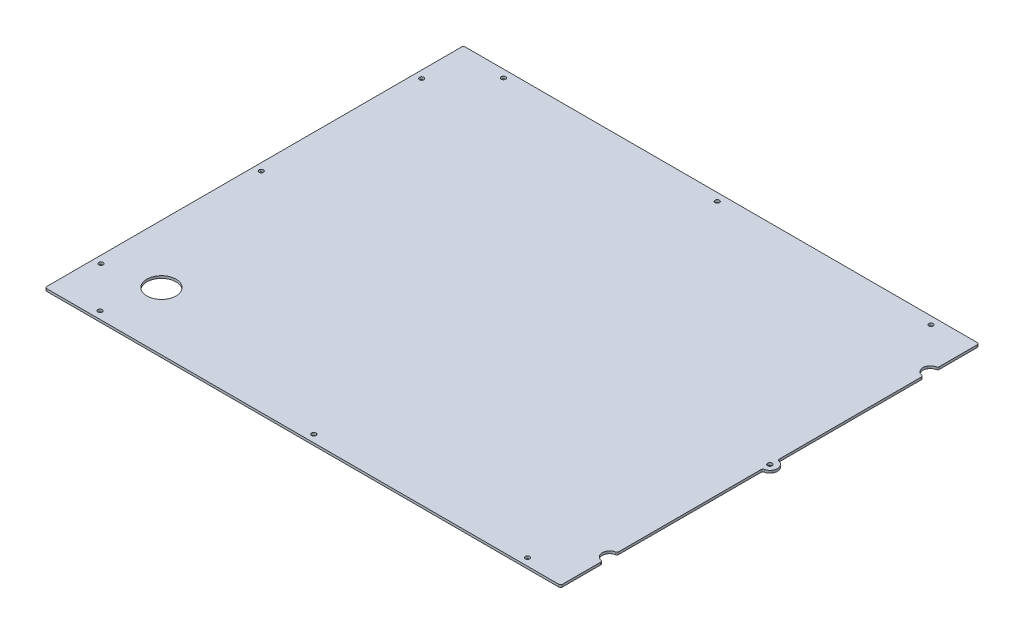
ISO-10303-21;
HEADER;
FILE_DESCRIPTION(('STEP AP214'),'2;1');
FILE_NAME('part.step','',(''),(''),'','','');
FILE_SCHEMA(('AUTOMOTIVE_DESIGN { 1 0 10303 214 1 1 1 1 }'));
ENDSEC;
DATA;
#1=APPLICATION_CONTEXT('core data for automotive mechanical design processes');
#2=APPLICATION_PROTOCOL_DEFINITION('international standard','automotive_design',2000,#1);
#3=PRODUCT_CONTEXT('',#1,'mechanical');
#4=PRODUCT('Part','Part','',(#3));
#5=PRODUCT_RELATED_PRODUCT_CATEGORY('part','',(#4));
#6=PRODUCT_DEFINITION_FORMATION('','',#4);
#7=PRODUCT_DEFINITION_CONTEXT('part definition',#1,'design');
#8=PRODUCT_DEFINITION('design','',#6,#7);
#9=PRODUCT_DEFINITION_SHAPE('','',#8);
#10=(LENGTH_UNIT() NAMED_UNIT(*) SI_UNIT(.MILLI.,.METRE.));
#11=(NAMED_UNIT(*) PLANE_ANGLE_UNIT() SI_UNIT($,.RADIAN.));
#12=(NAMED_UNIT(*) SI_UNIT($,.STERADIAN.) SOLID_ANGLE_UNIT());
#13=UNCERTAINTY_MEASURE_WITH_UNIT(LENGTH_MEASURE(1.E-05),#10,'distance_accuracy_value','');
#14=(GEOMETRIC_REPRESENTATION_CONTEXT(3) GLOBAL_UNCERTAINTY_ASSIGNED_CONTEXT((#13)) GLOBAL_UNIT_ASSIGNED_CONTEXT((#10,
#11,#12)) REPRESENTATION_CONTEXT('',''));
#15=CARTESIAN_POINT('',(0.,0.,0.));
#16=DIRECTION('',(0.,0.,1.));
#17=DIRECTION('',(1.,0.,0.));
#18=AXIS2_PLACEMENT_3D('',#15,#16,#17);
#19=CARTESIAN_POINT('',(337.058,3.175,-209.804));
#20=DIRECTION('',(0.,1.,0.));
#21=DIRECTION('',(0.,0.,1.));
#22=AXIS2_PLACEMENT_3D('',#19,#20,#21);
#23=PLANE('',#22);
#24=CARTESIAN_POINT('',(284.226000000001,3.175,-263.398));
#25=DIRECTION('',(0.,-1.,0.));
#26=DIRECTION('',(0.,0.,-1.));
#27=AXIS2_PLACEMENT_3D('',#24,#25,#26);
#28=CIRCLE('',#27,2.8956);
#29=CARTESIAN_POINT('',(284.226000000001,3.175,-266.2936));
#30=VERTEX_POINT('',#29);
#31=EDGE_CURVE('E402',#30,#30,#28,.T.);
#32=ORIENTED_EDGE('',*,*,#31,.T.);
#33=EDGE_LOOP('',(#32));
#34=FACE_BOUND('',#33,.T.);
#35=CARTESIAN_POINT('',(4.82600000000133,3.175,-263.398));
#36=DIRECTION('',(0.,-1.,0.));
#37=DIRECTION('',(0.,0.,-1.));
#38=AXIS2_PLACEMENT_3D('',#35,#36,#37);
#39=CIRCLE('',#38,2.8956);
#40=CARTESIAN_POINT('',(4.82600000000133,3.175,-266.2936));
#41=VERTEX_POINT('',#40);
#42=EDGE_CURVE('E396',#41,#41,#39,.T.);
#43=ORIENTED_EDGE('',*,*,#42,.T.);
#44=EDGE_LOOP('',(#43));
#45=FACE_BOUND('',#44,.T.);
#46=CARTESIAN_POINT('',(-274.573999999999,3.175,-263.398));
#47=DIRECTION('',(0.,-1.,0.));
#48=DIRECTION('',(0.,0.,-1.));
#49=AXIS2_PLACEMENT_3D('',#46,#47,#48);
#50=CIRCLE('',#49,2.8956);
#51=CARTESIAN_POINT('',(-274.573999999999,3.175,-266.2936));
#52=VERTEX_POINT('',#51);
#53=EDGE_CURVE('E390',#52,#52,#50,.T.);
#54=ORIENTED_EDGE('',*,*,#53,.T.);
#55=EDGE_LOOP('',(#54));
#56=FACE_BOUND('',#55,.T.);
#57=CARTESIAN_POINT('',(-327.406,3.175,-209.296));
#58=DIRECTION('',(0.,-1.,0.));
#59=DIRECTION('',(0.,0.,-1.));
#60=AXIS2_PLACEMENT_3D('',#57,#58,#59);
#61=CIRCLE('',#60,2.8956);
#62=CARTESIAN_POINT('',(-327.406,3.175,-212.1916));
#63=VERTEX_POINT('',#62);
#64=EDGE_CURVE('E384',#63,#63,#61,.T.);
#65=ORIENTED_EDGE('',*,*,#64,.T.);
#66=EDGE_LOOP('',(#65));
#67=FACE_BOUND('',#66,.T.);
#68=CARTESIAN_POINT('',(-327.406,3.175,0.253999999999921));
#69=DIRECTION('',(0.,-1.,0.));
#70=DIRECTION('',(0.,0.,-1.));
#71=AXIS2_PLACEMENT_3D('',#68,#69,#70);
#72=CIRCLE('',#71,2.8956);
#73=CARTESIAN_POINT('',(-327.406,3.175,-2.64160000000008));
#74=VERTEX_POINT('',#73);
#75=EDGE_CURVE('E378',#74,#74,#72,.T.);
#76=ORIENTED_EDGE('',*,*,#75,.T.);
#77=EDGE_LOOP('',(#76));
#78=FACE_BOUND('',#77,.T.);
#79=CARTESIAN_POINT('',(-327.406,3.175,209.804));
#80=DIRECTION('',(0.,-1.,0.));
#81=DIRECTION('',(0.,0.,-1.));
#82=AXIS2_PLACEMENT_3D('',#79,#80,#81);
#83=CIRCLE('',#82,2.8956);
#84=CARTESIAN_POINT('',(-327.406,3.175,206.9084));
#85=VERTEX_POINT('',#84);
#86=EDGE_CURVE('E372',#85,#85,#83,.T.);
#87=ORIENTED_EDGE('',*,*,#86,.T.);
#88=EDGE_LOOP('',(#87));
#89=FACE_BOUND('',#88,.T.);
#90=CARTESIAN_POINT('',(-274.573999999999,3.175,263.906));
#91=DIRECTION('',(0.,-1.,0.));
#92=DIRECTION('',(0.,0.,-1.));
#93=AXIS2_PLACEMENT_3D('',#90,#91,#92);
#94=CIRCLE('',#93,2.8956);
#95=CARTESIAN_POINT('',(-274.573999999999,3.175,261.0104));
#96=VERTEX_POINT('',#95);
#97=EDGE_CURVE('E366',#96,#96,#94,.T.);
#98=ORIENTED_EDGE('',*,*,#97,.T.);
#99=EDGE_LOOP('',(#98));
#100=FACE_BOUND('',#99,.T.);
#101=CARTESIAN_POINT('',(4.82600000000133,3.175,263.906));
#102=DIRECTION('',(0.,-1.,0.));
#103=DIRECTION('',(0.,0.,-1.));
#104=AXIS2_PLACEMENT_3D('',#101,#102,#103);
#105=CIRCLE('',#104,2.8956);
#106=CARTESIAN_POINT('',(4.82600000000133,3.175,261.0104));
#107=VERTEX_POINT('',#106);
#108=EDGE_CURVE('E360',#107,#107,#105,.T.);
#109=ORIENTED_EDGE('',*,*,#108,.T.);
#110=EDGE_LOOP('',(#109));
#111=FACE_BOUND('',#110,.T.);
#112=CARTESIAN_POINT('',(284.226000000001,3.175,263.906));
#113=DIRECTION('',(0.,-1.,0.));
#114=DIRECTION('',(0.,0.,-1.));
#115=AXIS2_PLACEMENT_3D('',#112,#113,#114);
#116=CIRCLE('',#115,2.8956);
#117=CARTESIAN_POINT('',(284.226000000001,3.175,261.0104));
#118=VERTEX_POINT('',#117);
#119=EDGE_CURVE('E352',#118,#118,#116,.T.);
#120=ORIENTED_EDGE('',*,*,#119,.T.);
#121=EDGE_LOOP('',(#120));
#122=FACE_BOUND('',#121,.T.);
#123=CARTESIAN_POINT('',(-260.858,3.175,197.358));
#124=DIRECTION('',(0.,1.,0.));
#125=DIRECTION('',(0.,0.,1.));
#126=AXIS2_PLACEMENT_3D('',#123,#124,#125);
#127=CIRCLE('',#126,19.05);
#128=CARTESIAN_POINT('',(-260.858,3.175,216.408));
#129=VERTEX_POINT('',#128);
#130=EDGE_CURVE('E189',#129,#129,#127,.T.);
#131=ORIENTED_EDGE('',*,*,#130,.F.);
#132=EDGE_LOOP('',(#131));
#133=FACE_BOUND('',#132,.T.);
#134=DIRECTION('',(-1.,0.,0.));
#135=VECTOR('',#134,1.);
#136=CARTESIAN_POINT('',(-337.058,3.175,-273.558));
#137=LINE('',#136,#135);
#138=CARTESIAN_POINT('',(334.518,3.175,-273.558));
#139=VERTEX_POINT('',#138);
#140=CARTESIAN_POINT('',(-334.518,3.175,-273.558));
#141=VERTEX_POINT('',#140);
#142=EDGE_CURVE('E205',#139,#141,#137,.T.);
#143=ORIENTED_EDGE('',*,*,#142,.T.);
#144=CARTESIAN_POINT('',(-334.518,3.175,-271.018));
#145=DIRECTION('',(0.,1.,0.));
#146=DIRECTION('',(0.,0.,1.));
#147=AXIS2_PLACEMENT_3D('',#144,#145,#146);
#148=CIRCLE('',#147,2.54);
#149=CARTESIAN_POINT('',(-337.058,3.175,-271.018));
#150=VERTEX_POINT('',#149);
#151=EDGE_CURVE('E302',#141,#150,#148,.T.);
#152=ORIENTED_EDGE('',*,*,#151,.T.);
#153=DIRECTION('',(0.,0.,1.));
#154=VECTOR('',#153,1.);
#155=CARTESIAN_POINT('',(-337.058,3.175,273.558));
#156=LINE('',#155,#154);
#157=CARTESIAN_POINT('',(-337.058,3.175,271.018));
#158=VERTEX_POINT('',#157);
#159=EDGE_CURVE('E208',#150,#158,#156,.T.);
#160=ORIENTED_EDGE('',*,*,#159,.T.);
#161=CARTESIAN_POINT('',(-334.518,3.175,271.018));
#162=DIRECTION('',(0.,1.,0.));
#163=DIRECTION('',(0.,0.,1.));
#164=AXIS2_PLACEMENT_3D('',#161,#162,#163);
#165=CIRCLE('',#164,2.54);
#166=CARTESIAN_POINT('',(-334.518,3.175,273.558));
#167=VERTEX_POINT('',#166);
#168=EDGE_CURVE('E300',#158,#167,#165,.T.);
#169=ORIENTED_EDGE('',*,*,#168,.T.);
#170=DIRECTION('',(1.,0.,0.));
#171=VECTOR('',#170,1.);
#172=CARTESIAN_POINT('',(-337.058,3.175,273.558));
#173=LINE('',#172,#171);
#174=CARTESIAN_POINT('',(334.518,3.175,273.558));
#175=VERTEX_POINT('',#174);
#176=EDGE_CURVE('E212',#167,#175,#173,.T.);
#177=ORIENTED_EDGE('',*,*,#176,.T.);
#178=CARTESIAN_POINT('',(334.518,3.175,271.018));
#179=DIRECTION('',(0.,1.,0.));
#180=DIRECTION('',(0.,0.,1.));
#181=AXIS2_PLACEMENT_3D('',#178,#179,#180);
#182=CIRCLE('',#181,2.54);
#183=CARTESIAN_POINT('',(337.058,3.175,271.018));
#184=VERTEX_POINT('',#183);
#185=EDGE_CURVE('E298',#175,#184,#182,.T.);
#186=ORIENTED_EDGE('',*,*,#185,.T.);
#187=DIRECTION('',(0.,0.,-1.));
#188=VECTOR('',#187,1.);
#189=CARTESIAN_POINT('',(337.058,3.175,273.558));
#190=LINE('',#189,#188);
#191=CARTESIAN_POINT('',(337.058,3.175,221.220481707814));
#192=VERTEX_POINT('',#191);
#193=EDGE_CURVE('E215',#184,#192,#190,.T.);
#194=ORIENTED_EDGE('',*,*,#193,.T.);
#195=CARTESIAN_POINT('',(334.518,3.175,221.220481707814));
#196=DIRECTION('',(0.,1.,0.));
#197=DIRECTION('',(0.,0.,1.));
#198=AXIS2_PLACEMENT_3D('',#195,#196,#197);
#199=CIRCLE('',#198,2.54);
#200=CARTESIAN_POINT('',(335.047166666667,3.175,218.736214685353));
#201=VERTEX_POINT('',#200);
#202=EDGE_CURVE('E296',#192,#201,#199,.T.);
#203=ORIENTED_EDGE('',*,*,#202,.T.);
#204=CARTESIAN_POINT('',(337.058,3.175,209.296));
#205=DIRECTION('',(0.,-1.,0.));
#206=DIRECTION('',(0.,0.,1.));
#207=AXIS2_PLACEMENT_3D('',#204,#205,#206);
#208=CIRCLE('',#207,9.65199999999997);
#209=CARTESIAN_POINT('',(335.047166666667,3.175,199.855785314647));
#210=VERTEX_POINT('',#209);
#211=EDGE_CURVE('E218',#201,#210,#208,.T.);
#212=ORIENTED_EDGE('',*,*,#211,.T.);
#213=CARTESIAN_POINT('',(334.518,3.175,197.371518292186));
#214=DIRECTION('',(0.,1.,0.));
#215=DIRECTION('',(0.,0.,1.));
#216=AXIS2_PLACEMENT_3D('',#213,#214,#215);
#217=CIRCLE('',#216,2.54);
#218=CARTESIAN_POINT('',(337.058,3.175,197.371518292186));
#219=VERTEX_POINT('',#218);
#220=EDGE_CURVE('E294',#210,#219,#217,.T.);
#221=ORIENTED_EDGE('',*,*,#220,.T.);
#222=DIRECTION('',(0.,0.,-1.));
#223=VECTOR('',#222,1.);
#224=CARTESIAN_POINT('',(337.058,3.175,199.644));
#225=LINE('',#224,#223);
#226=CARTESIAN_POINT('',(337.058,3.175,11.6704817078144));
#227=VERTEX_POINT('',#226);
#228=EDGE_CURVE('E221',#219,#227,#225,.T.);
#229=ORIENTED_EDGE('',*,*,#228,.T.);
#230=CARTESIAN_POINT('',(339.598,3.175,11.6704817078144));
#231=DIRECTION('',(0.,1.,0.));
#232=DIRECTION('',(0.,0.,1.));
#233=AXIS2_PLACEMENT_3D('',#230,#231,#232);
#234=CIRCLE('',#233,2.54);
#235=CARTESIAN_POINT('',(339.068833333333,3.175,9.18621468535305));
#236=VERTEX_POINT('',#235);
#237=EDGE_CURVE('E345',#227,#236,#234,.F.);
#238=ORIENTED_EDGE('',*,*,#237,.T.);
#239=CARTESIAN_POINT('',(337.058,3.175,-0.254000000000004));
#240=DIRECTION('',(0.,1.,0.));
#241=DIRECTION('',(0.,0.,1.));
#242=AXIS2_PLACEMENT_3D('',#239,#240,#241);
#243=CIRCLE('',#242,9.65199999999998);
#244=CARTESIAN_POINT('',(339.068833333333,3.175,-9.69421468535305));
#245=VERTEX_POINT('',#244);
#246=EDGE_CURVE('E224',#236,#245,#243,.T.);
#247=ORIENTED_EDGE('',*,*,#246,.T.);
#248=CARTESIAN_POINT('',(339.598,3.175,-12.1784817078144));
#249=DIRECTION('',(0.,1.,0.));
#250=DIRECTION('',(0.,0.,1.));
#251=AXIS2_PLACEMENT_3D('',#248,#249,#250);
#252=CIRCLE('',#251,2.54);
#253=CARTESIAN_POINT('',(337.058,3.175,-12.1784817078144));
#254=VERTEX_POINT('',#253);
#255=EDGE_CURVE('E349',#245,#254,#252,.F.);
#256=ORIENTED_EDGE('',*,*,#255,.T.);
#257=DIRECTION('',(0.,0.,-1.));
#258=VECTOR('',#257,1.);
#259=CARTESIAN_POINT('',(337.058,3.175,-9.90599999999999));
#260=LINE('',#259,#258);
#261=CARTESIAN_POINT('',(337.058,3.175,-197.879518292186));
#262=VERTEX_POINT('',#261);
#263=EDGE_CURVE('E227',#254,#262,#260,.T.);
#264=ORIENTED_EDGE('',*,*,#263,.T.);
#265=CARTESIAN_POINT('',(334.518,3.175,-197.879518292186));
#266=DIRECTION('',(0.,1.,0.));
#267=DIRECTION('',(0.,0.,1.));
#268=AXIS2_PLACEMENT_3D('',#265,#266,#267);
#269=CIRCLE('',#268,2.54);
#270=CARTESIAN_POINT('',(335.047166666667,3.175,-200.363785314647));
#271=VERTEX_POINT('',#270);
#272=EDGE_CURVE('E292',#262,#271,#269,.T.);
#273=ORIENTED_EDGE('',*,*,#272,.T.);
#274=CARTESIAN_POINT('',(337.058,3.175,-209.804));
#275=DIRECTION('',(0.,-1.,0.));
#276=DIRECTION('',(0.,0.,1.));
#277=AXIS2_PLACEMENT_3D('',#274,#275,#276);
#278=CIRCLE('',#277,9.65199999999997);
#279=CARTESIAN_POINT('',(335.047166666667,3.175,-219.244214685353));
#280=VERTEX_POINT('',#279);
#281=EDGE_CURVE('E230',#271,#280,#278,.T.);
#282=ORIENTED_EDGE('',*,*,#281,.T.);
#283=CARTESIAN_POINT('',(334.518,3.175,-221.728481707814));
#284=DIRECTION('',(0.,1.,0.));
#285=DIRECTION('',(0.,0.,1.));
#286=AXIS2_PLACEMENT_3D('',#283,#284,#285);
#287=CIRCLE('',#286,2.54);
#288=CARTESIAN_POINT('',(337.058,3.175,-221.728481707814));
#289=VERTEX_POINT('',#288);
#290=EDGE_CURVE('E290',#280,#289,#287,.T.);
#291=ORIENTED_EDGE('',*,*,#290,.T.);
#292=DIRECTION('',(0.,0.,-1.));
#293=VECTOR('',#292,1.);
#294=CARTESIAN_POINT('',(337.058,3.175,-219.456));
#295=LINE('',#294,#293);
#296=CARTESIAN_POINT('',(337.058,3.175,-271.018));
#297=VERTEX_POINT('',#296);
#298=EDGE_CURVE('E233',#289,#297,#295,.T.);
#299=ORIENTED_EDGE('',*,*,#298,.T.);
#300=CARTESIAN_POINT('',(334.518,3.175,-271.018));
#301=DIRECTION('',(0.,1.,0.));
#302=DIRECTION('',(0.,0.,1.));
#303=AXIS2_PLACEMENT_3D('',#300,#301,#302);
#304=CIRCLE('',#303,2.54);
#305=EDGE_CURVE('E288',#297,#139,#304,.T.);
#306=ORIENTED_EDGE('',*,*,#305,.T.);
#307=EDGE_LOOP('',(#143,#152,#160,#169,#177,#186,#194,#203,#212,#221,#229,#238,#247,#256,#264,
#273,#282,#291,#299,#306));
#308=FACE_BOUND('',#307,.T.);
#309=CARTESIAN_POINT('',(337.058,3.175,-0.254000000000004));
#310=DIRECTION('',(0.,1.,0.));
#311=DIRECTION('',(0.,0.,1.));
#312=AXIS2_PLACEMENT_3D('',#309,#310,#311);
#313=CIRCLE('',#312,2.8956);
#314=CARTESIAN_POINT('',(339.942438135926,3.175,3.68768058624236E-11));
#315=VERTEX_POINT('',#314);
#316=CARTESIAN_POINT('',(334.173561864068,3.175,-3.56236307813562E-11));
#317=VERTEX_POINT('',#316);
#318=EDGE_CURVE('E194',#315,#317,#313,.T.);
#319=ORIENTED_EDGE('',*,*,#318,.F.);
#320=CARTESIAN_POINT('',(337.057999999994,3.175,0.254000000001253));
#321=DIRECTION('',(0.,-1.,0.));
#322=DIRECTION('',(0.,0.,-1.));
#323=AXIS2_PLACEMENT_3D('',#320,#321,#322);
#324=CIRCLE('',#323,2.8956);
#325=EDGE_CURVE('E184',#315,#317,#324,.T.);
#326=ORIENTED_EDGE('',*,*,#325,.T.);
#327=EDGE_LOOP('',(#319,#326));
#328=FACE_BOUND('',#327,.T.);
#329=ADVANCED_FACE('F35',(#34,#45,#56,#67,#78,#89,#100,#111,#122,#133,#308,#328),#23,.T.);
#330=CARTESIAN_POINT('',(337.058,0.,-209.804));
#331=DIRECTION('',(0.,1.,0.));
#332=DIRECTION('',(0.,0.,1.));
#333=AXIS2_PLACEMENT_3D('',#330,#331,#332);
#334=PLANE('',#333);
#335=CARTESIAN_POINT('',(284.226000000001,0.,-263.398));
#336=DIRECTION('',(0.,-1.,0.));
#337=DIRECTION('',(0.,0.,-1.));
#338=AXIS2_PLACEMENT_3D('',#335,#336,#337);
#339=CIRCLE('',#338,2.8956);
#340=CARTESIAN_POINT('',(284.226000000001,0.,-266.2936));
#341=VERTEX_POINT('',#340);
#342=EDGE_CURVE('E405',#341,#341,#339,.T.);
#343=ORIENTED_EDGE('',*,*,#342,.F.);
#344=EDGE_LOOP('',(#343));
#345=FACE_BOUND('',#344,.T.);
#346=CARTESIAN_POINT('',(4.82600000000133,0.,-263.398));
#347=DIRECTION('',(0.,-1.,0.));
#348=DIRECTION('',(0.,0.,-1.));
#349=AXIS2_PLACEMENT_3D('',#346,#347,#348);
#350=CIRCLE('',#349,2.8956);
#351=CARTESIAN_POINT('',(4.82600000000133,0.,-266.2936));
#352=VERTEX_POINT('',#351);
#353=EDGE_CURVE('E399',#352,#352,#350,.T.);
#354=ORIENTED_EDGE('',*,*,#353,.F.);
#355=EDGE_LOOP('',(#354));
#356=FACE_BOUND('',#355,.T.);
#357=CARTESIAN_POINT('',(-274.573999999999,0.,-263.398));
#358=DIRECTION('',(0.,-1.,0.));
#359=DIRECTION('',(0.,0.,-1.));
#360=AXIS2_PLACEMENT_3D('',#357,#358,#359);
#361=CIRCLE('',#360,2.8956);
#362=CARTESIAN_POINT('',(-274.573999999999,0.,-266.2936));
#363=VERTEX_POINT('',#362);
#364=EDGE_CURVE('E393',#363,#363,#361,.T.);
#365=ORIENTED_EDGE('',*,*,#364,.F.);
#366=EDGE_LOOP('',(#365));
#367=FACE_BOUND('',#366,.T.);
#368=CARTESIAN_POINT('',(-327.406,0.,-209.296));
#369=DIRECTION('',(0.,-1.,0.));
#370=DIRECTION('',(0.,0.,-1.));
#371=AXIS2_PLACEMENT_3D('',#368,#369,#370);
#372=CIRCLE('',#371,2.8956);
#373=CARTESIAN_POINT('',(-327.406,0.,-212.1916));
#374=VERTEX_POINT('',#373);
#375=EDGE_CURVE('E387',#374,#374,#372,.T.);
#376=ORIENTED_EDGE('',*,*,#375,.F.);
#377=EDGE_LOOP('',(#376));
#378=FACE_BOUND('',#377,.T.);
#379=CARTESIAN_POINT('',(-327.406,0.,0.253999999999921));
#380=DIRECTION('',(0.,-1.,0.));
#381=DIRECTION('',(0.,0.,-1.));
#382=AXIS2_PLACEMENT_3D('',#379,#380,#381);
#383=CIRCLE('',#382,2.8956);
#384=CARTESIAN_POINT('',(-327.406,0.,-2.64160000000008));
#385=VERTEX_POINT('',#384);
#386=EDGE_CURVE('E381',#385,#385,#383,.T.);
#387=ORIENTED_EDGE('',*,*,#386,.F.);
#388=EDGE_LOOP('',(#387));
#389=FACE_BOUND('',#388,.T.);
#390=CARTESIAN_POINT('',(-327.406,0.,209.804));
#391=DIRECTION('',(0.,-1.,0.));
#392=DIRECTION('',(0.,0.,-1.));
#393=AXIS2_PLACEMENT_3D('',#390,#391,#392);
#394=CIRCLE('',#393,2.8956);
#395=CARTESIAN_POINT('',(-327.406,0.,206.9084));
#396=VERTEX_POINT('',#395);
#397=EDGE_CURVE('E375',#396,#396,#394,.T.);
#398=ORIENTED_EDGE('',*,*,#397,.F.);
#399=EDGE_LOOP('',(#398));
#400=FACE_BOUND('',#399,.T.);
#401=CARTESIAN_POINT('',(-274.573999999999,0.,263.906));
#402=DIRECTION('',(0.,-1.,0.));
#403=DIRECTION('',(0.,0.,-1.));
#404=AXIS2_PLACEMENT_3D('',#401,#402,#403);
#405=CIRCLE('',#404,2.8956);
#406=CARTESIAN_POINT('',(-274.573999999999,0.,261.0104));
#407=VERTEX_POINT('',#406);
#408=EDGE_CURVE('E369',#407,#407,#405,.T.);
#409=ORIENTED_EDGE('',*,*,#408,.F.);
#410=EDGE_LOOP('',(#409));
#411=FACE_BOUND('',#410,.T.);
#412=CARTESIAN_POINT('',(4.82600000000133,0.,263.906));
#413=DIRECTION('',(0.,-1.,0.));
#414=DIRECTION('',(0.,0.,-1.));
#415=AXIS2_PLACEMENT_3D('',#412,#413,#414);
#416=CIRCLE('',#415,2.8956);
#417=CARTESIAN_POINT('',(4.82600000000133,0.,261.0104));
#418=VERTEX_POINT('',#417);
#419=EDGE_CURVE('E363',#418,#418,#416,.T.);
#420=ORIENTED_EDGE('',*,*,#419,.F.);
#421=EDGE_LOOP('',(#420));
#422=FACE_BOUND('',#421,.T.);
#423=CARTESIAN_POINT('',(284.226000000001,0.,263.906));
#424=DIRECTION('',(0.,-1.,0.));
#425=DIRECTION('',(0.,0.,-1.));
#426=AXIS2_PLACEMENT_3D('',#423,#424,#425);
#427=CIRCLE('',#426,2.8956);
#428=CARTESIAN_POINT('',(284.226000000001,0.,261.0104));
#429=VERTEX_POINT('',#428);
#430=EDGE_CURVE('E355',#429,#429,#427,.T.);
#431=ORIENTED_EDGE('',*,*,#430,.F.);
#432=EDGE_LOOP('',(#431));
#433=FACE_BOUND('',#432,.T.);
#434=DIRECTION('',(0.,0.,1.));
#435=VECTOR('',#434,1.);
#436=CARTESIAN_POINT('',(-337.058,0.,273.558));
#437=LINE('',#436,#435);
#438=CARTESIAN_POINT('',(-337.058,0.,-271.018));
#439=VERTEX_POINT('',#438);
#440=CARTESIAN_POINT('',(-337.058,0.,271.018));
#441=VERTEX_POINT('',#440);
#442=EDGE_CURVE('E238',#439,#441,#437,.T.);
#443=ORIENTED_EDGE('',*,*,#442,.F.);
#444=CARTESIAN_POINT('',(-334.518,0.,-271.018));
#445=DIRECTION('',(0.,1.,0.));
#446=DIRECTION('',(0.,0.,1.));
#447=AXIS2_PLACEMENT_3D('',#444,#445,#446);
#448=CIRCLE('',#447,2.54);
#449=CARTESIAN_POINT('',(-334.518,0.,-273.558));
#450=VERTEX_POINT('',#449);
#451=EDGE_CURVE('E281',#439,#450,#448,.F.);
#452=ORIENTED_EDGE('',*,*,#451,.T.);
#453=DIRECTION('',(-1.,0.,0.));
#454=VECTOR('',#453,1.);
#455=CARTESIAN_POINT('',(-337.058,0.,-273.558));
#456=LINE('',#455,#454);
#457=CARTESIAN_POINT('',(334.518,0.,-273.558));
#458=VERTEX_POINT('',#457);
#459=EDGE_CURVE('E199',#458,#450,#456,.T.);
#460=ORIENTED_EDGE('',*,*,#459,.F.);
#461=CARTESIAN_POINT('',(334.518,0.,-271.018));
#462=DIRECTION('',(0.,1.,0.));
#463=DIRECTION('',(0.,0.,1.));
#464=AXIS2_PLACEMENT_3D('',#461,#462,#463);
#465=CIRCLE('',#464,2.54);
#466=CARTESIAN_POINT('',(337.058,0.,-271.018));
#467=VERTEX_POINT('',#466);
#468=EDGE_CURVE('E267',#458,#467,#465,.F.);
#469=ORIENTED_EDGE('',*,*,#468,.T.);
#470=DIRECTION('',(0.,0.,-1.));
#471=VECTOR('',#470,1.);
#472=CARTESIAN_POINT('',(337.058,0.,-219.456));
#473=LINE('',#472,#471);
#474=CARTESIAN_POINT('',(337.058,0.,-221.728481707814));
#475=VERTEX_POINT('',#474);
#476=EDGE_CURVE('E209',#475,#467,#473,.T.);
#477=ORIENTED_EDGE('',*,*,#476,.F.);
#478=CARTESIAN_POINT('',(334.518,0.,-221.728481707814));
#479=DIRECTION('',(0.,1.,0.));
#480=DIRECTION('',(0.,0.,1.));
#481=AXIS2_PLACEMENT_3D('',#478,#479,#480);
#482=CIRCLE('',#481,2.54);
#483=CARTESIAN_POINT('',(335.047166666667,0.,-219.244214685353));
#484=VERTEX_POINT('',#483);
#485=EDGE_CURVE('E269',#475,#484,#482,.F.);
#486=ORIENTED_EDGE('',*,*,#485,.T.);
#487=CARTESIAN_POINT('',(337.058,0.,-209.804));
#488=DIRECTION('',(0.,-1.,0.));
#489=DIRECTION('',(0.,0.,1.));
#490=AXIS2_PLACEMENT_3D('',#487,#488,#489);
#491=CIRCLE('',#490,9.65199999999997);
#492=CARTESIAN_POINT('',(335.047166666667,0.,-200.363785314647));
#493=VERTEX_POINT('',#492);
#494=EDGE_CURVE('E259',#493,#484,#491,.T.);
#495=ORIENTED_EDGE('',*,*,#494,.F.);
#496=CARTESIAN_POINT('',(334.518,0.,-197.879518292186));
#497=DIRECTION('',(0.,1.,0.));
#498=DIRECTION('',(0.,0.,1.));
#499=AXIS2_PLACEMENT_3D('',#496,#497,#498);
#500=CIRCLE('',#499,2.54);
#501=CARTESIAN_POINT('',(337.058,0.,-197.879518292186));
#502=VERTEX_POINT('',#501);
#503=EDGE_CURVE('E271',#493,#502,#500,.F.);
#504=ORIENTED_EDGE('',*,*,#503,.T.);
#505=DIRECTION('',(0.,0.,-1.));
#506=VECTOR('',#505,1.);
#507=CARTESIAN_POINT('',(337.058,0.,-9.90599999999999));
#508=LINE('',#507,#506);
#509=CARTESIAN_POINT('',(337.058,0.,-12.1784817078144));
#510=VERTEX_POINT('',#509);
#511=EDGE_CURVE('E256',#510,#502,#508,.T.);
#512=ORIENTED_EDGE('',*,*,#511,.F.);
#513=CARTESIAN_POINT('',(339.598,0.,-12.1784817078144));
#514=DIRECTION('',(0.,1.,0.));
#515=DIRECTION('',(0.,0.,1.));
#516=AXIS2_PLACEMENT_3D('',#513,#514,#515);
#517=CIRCLE('',#516,2.54);
#518=CARTESIAN_POINT('',(339.068833333333,0.,-9.69421468535305));
#519=VERTEX_POINT('',#518);
#520=EDGE_CURVE('E347',#510,#519,#517,.T.);
#521=ORIENTED_EDGE('',*,*,#520,.T.);
#522=CARTESIAN_POINT('',(337.058,0.,-0.254000000000004));
#523=DIRECTION('',(0.,1.,0.));
#524=DIRECTION('',(0.,0.,1.));
#525=AXIS2_PLACEMENT_3D('',#522,#523,#524);
#526=CIRCLE('',#525,9.65199999999998);
#527=CARTESIAN_POINT('',(339.068833333333,0.,9.18621468535305));
#528=VERTEX_POINT('',#527);
#529=EDGE_CURVE('E253',#528,#519,#526,.T.);
#530=ORIENTED_EDGE('',*,*,#529,.F.);
#531=CARTESIAN_POINT('',(339.598,0.,11.6704817078144));
#532=DIRECTION('',(0.,1.,0.));
#533=DIRECTION('',(0.,0.,1.));
#534=AXIS2_PLACEMENT_3D('',#531,#532,#533);
#535=CIRCLE('',#534,2.54);
#536=CARTESIAN_POINT('',(337.058,0.,11.6704817078144));
#537=VERTEX_POINT('',#536);
#538=EDGE_CURVE('E343',#528,#537,#535,.T.);
#539=ORIENTED_EDGE('',*,*,#538,.T.);
#540=DIRECTION('',(0.,0.,-1.));
#541=VECTOR('',#540,1.);
#542=CARTESIAN_POINT('',(337.058,0.,199.644));
#543=LINE('',#542,#541);
#544=CARTESIAN_POINT('',(337.058,0.,197.371518292186));
#545=VERTEX_POINT('',#544);
#546=EDGE_CURVE('E250',#545,#537,#543,.T.);
#547=ORIENTED_EDGE('',*,*,#546,.F.);
#548=CARTESIAN_POINT('',(334.518,0.,197.371518292186));
#549=DIRECTION('',(0.,1.,0.));
#550=DIRECTION('',(0.,0.,1.));
#551=AXIS2_PLACEMENT_3D('',#548,#549,#550);
#552=CIRCLE('',#551,2.54);
#553=CARTESIAN_POINT('',(335.047166666667,0.,199.855785314647));
#554=VERTEX_POINT('',#553);
#555=EDGE_CURVE('E273',#545,#554,#552,.F.);
#556=ORIENTED_EDGE('',*,*,#555,.T.);
#557=CARTESIAN_POINT('',(337.058,0.,209.296));
#558=DIRECTION('',(0.,-1.,0.));
#559=DIRECTION('',(0.,0.,1.));
#560=AXIS2_PLACEMENT_3D('',#557,#558,#559);
#561=CIRCLE('',#560,9.65199999999997);
#562=CARTESIAN_POINT('',(335.047166666667,0.,218.736214685353));
#563=VERTEX_POINT('',#562);
#564=EDGE_CURVE('E247',#563,#554,#561,.T.);
#565=ORIENTED_EDGE('',*,*,#564,.F.);
#566=CARTESIAN_POINT('',(334.518,0.,221.220481707814));
#567=DIRECTION('',(0.,1.,0.));
#568=DIRECTION('',(0.,0.,1.));
#569=AXIS2_PLACEMENT_3D('',#566,#567,#568);
#570=CIRCLE('',#569,2.54);
#571=CARTESIAN_POINT('',(337.058,0.,221.220481707814));
#572=VERTEX_POINT('',#571);
#573=EDGE_CURVE('E275',#563,#572,#570,.F.);
#574=ORIENTED_EDGE('',*,*,#573,.T.);
#575=DIRECTION('',(0.,0.,-1.));
#576=VECTOR('',#575,1.);
#577=CARTESIAN_POINT('',(337.058,0.,273.558));
#578=LINE('',#577,#576);
#579=CARTESIAN_POINT('',(337.058,0.,271.018));
#580=VERTEX_POINT('',#579);
#581=EDGE_CURVE('E244',#580,#572,#578,.T.);
#582=ORIENTED_EDGE('',*,*,#581,.F.);
#583=CARTESIAN_POINT('',(334.518,0.,271.018));
#584=DIRECTION('',(0.,1.,0.));
#585=DIRECTION('',(0.,0.,1.));
#586=AXIS2_PLACEMENT_3D('',#583,#584,#585);
#587=CIRCLE('',#586,2.54);
#588=CARTESIAN_POINT('',(334.518,0.,273.558));
#589=VERTEX_POINT('',#588);
#590=EDGE_CURVE('E277',#580,#589,#587,.F.);
#591=ORIENTED_EDGE('',*,*,#590,.T.);
#592=DIRECTION('',(1.,0.,0.));
#593=VECTOR('',#592,1.);
#594=CARTESIAN_POINT('',(-337.058,0.,273.558));
#595=LINE('',#594,#593);
#596=CARTESIAN_POINT('',(-334.518,0.,273.558));
#597=VERTEX_POINT('',#596);
#598=EDGE_CURVE('E241',#597,#589,#595,.T.);
#599=ORIENTED_EDGE('',*,*,#598,.F.);
#600=CARTESIAN_POINT('',(-334.518,0.,271.018));
#601=DIRECTION('',(0.,1.,0.));
#602=DIRECTION('',(0.,0.,1.));
#603=AXIS2_PLACEMENT_3D('',#600,#601,#602);
#604=CIRCLE('',#603,2.54);
#605=EDGE_CURVE('E279',#597,#441,#604,.F.);
#606=ORIENTED_EDGE('',*,*,#605,.T.);
#607=EDGE_LOOP('',(#443,#452,#460,#469,#477,#486,#495,#504,#512,#521,#530,#539,#547,#556,#565,
#574,#582,#591,#599,#606));
#608=FACE_BOUND('',#607,.T.);
#609=CARTESIAN_POINT('',(-260.858,0.,197.358));
#610=DIRECTION('',(0.,1.,0.));
#611=DIRECTION('',(0.,0.,1.));
#612=AXIS2_PLACEMENT_3D('',#609,#610,#611);
#613=CIRCLE('',#612,19.05);
#614=CARTESIAN_POINT('',(-260.858,0.,216.408));
#615=VERTEX_POINT('',#614);
#616=EDGE_CURVE('E197',#615,#615,#613,.T.);
#617=ORIENTED_EDGE('',*,*,#616,.T.);
#618=EDGE_LOOP('',(#617));
#619=FACE_BOUND('',#618,.T.);
#620=CARTESIAN_POINT('',(337.057999999994,0.,0.254000000001253));
#621=DIRECTION('',(0.,-1.,0.));
#622=DIRECTION('',(0.,0.,-1.));
#623=AXIS2_PLACEMENT_3D('',#620,#621,#622);
#624=CIRCLE('',#623,2.8956);
#625=CARTESIAN_POINT('',(339.942438135926,0.,3.68768058624236E-11));
#626=VERTEX_POINT('',#625);
#627=CARTESIAN_POINT('',(334.173561864068,0.,-3.56240644622252E-11));
#628=VERTEX_POINT('',#627);
#629=EDGE_CURVE('E50',#626,#628,#624,.T.);
#630=ORIENTED_EDGE('',*,*,#629,.F.);
#631=CARTESIAN_POINT('',(337.058,0.,-0.254000000000004));
#632=DIRECTION('',(0.,1.,0.));
#633=DIRECTION('',(0.,0.,1.));
#634=AXIS2_PLACEMENT_3D('',#631,#632,#633);
#635=CIRCLE('',#634,2.8956);
#636=EDGE_CURVE('E196',#626,#628,#635,.T.);
#637=ORIENTED_EDGE('',*,*,#636,.T.);
#638=EDGE_LOOP('',(#630,#637));
#639=FACE_BOUND('',#638,.T.);
#640=ADVANCED_FACE('F351',(#345,#356,#367,#378,#389,#400,#411,#422,#433,#608,#619,#639),#334,.F.);
#641=CARTESIAN_POINT('',(-337.058,3.175,-273.558));
#642=DIRECTION('',(0.,0.,1.));
#643=DIRECTION('',(1.,0.,0.));
#644=AXIS2_PLACEMENT_3D('',#641,#642,#643);
#645=PLANE('',#644);
#646=ORIENTED_EDGE('',*,*,#459,.T.);
#647=DIRECTION('',(0.,-1.,0.));
#648=VECTOR('',#647,1.);
#649=CARTESIAN_POINT('',(-334.518,3.175,-273.558));
#650=LINE('',#649,#648);
#651=EDGE_CURVE('E286',#450,#141,#650,.F.);
#652=ORIENTED_EDGE('',*,*,#651,.T.);
#653=ORIENTED_EDGE('',*,*,#142,.F.);
#654=DIRECTION('',(0.,-1.,0.));
#655=VECTOR('',#654,1.);
#656=CARTESIAN_POINT('',(334.518,3.175,-273.558));
#657=LINE('',#656,#655);
#658=EDGE_CURVE('E283',#139,#458,#657,.T.);
#659=ORIENTED_EDGE('',*,*,#658,.T.);
#660=EDGE_LOOP('',(#646,#652,#653,#659));
#661=FACE_BOUND('',#660,.T.);
#662=ADVANCED_FACE('F413',(#661),#645,.F.);
#663=CARTESIAN_POINT('',(-337.058,3.175,273.558));
#664=DIRECTION('',(1.,0.,0.));
#665=DIRECTION('',(0.,0.,-1.));
#666=AXIS2_PLACEMENT_3D('',#663,#664,#665);
#667=PLANE('',#666);
#668=ORIENTED_EDGE('',*,*,#159,.F.);
#669=DIRECTION('',(0.,-1.,0.));
#670=VECTOR('',#669,1.);
#671=CARTESIAN_POINT('',(-337.058,3.175,-271.018));
#672=LINE('',#671,#670);
#673=EDGE_CURVE('E264',#150,#439,#672,.T.);
#674=ORIENTED_EDGE('',*,*,#673,.T.);
#675=ORIENTED_EDGE('',*,*,#442,.T.);
#676=DIRECTION('',(0.,-1.,0.));
#677=VECTOR('',#676,1.);
#678=CARTESIAN_POINT('',(-337.058,3.175,271.018));
#679=LINE('',#678,#677);
#680=EDGE_CURVE('E235',#441,#158,#679,.F.);
#681=ORIENTED_EDGE('',*,*,#680,.T.);
#682=EDGE_LOOP('',(#668,#674,#675,#681));
#683=FACE_BOUND('',#682,.T.);
#684=ADVANCED_FACE('F457',(#683),#667,.F.);
#685=CARTESIAN_POINT('',(-337.058,3.175,273.558));
#686=DIRECTION('',(0.,0.,-1.));
#687=DIRECTION('',(-1.,0.,0.));
#688=AXIS2_PLACEMENT_3D('',#685,#686,#687);
#689=PLANE('',#688);
#690=ORIENTED_EDGE('',*,*,#176,.F.);
#691=DIRECTION('',(0.,-1.,0.));
#692=VECTOR('',#691,1.);
#693=CARTESIAN_POINT('',(-334.518,3.175,273.558));
#694=LINE('',#693,#692);
#695=EDGE_CURVE('E306',#167,#597,#694,.T.);
#696=ORIENTED_EDGE('',*,*,#695,.T.);
#697=ORIENTED_EDGE('',*,*,#598,.T.);
#698=DIRECTION('',(0.,-1.,0.));
#699=VECTOR('',#698,1.);
#700=CARTESIAN_POINT('',(334.518,3.175,273.558));
#701=LINE('',#700,#699);
#702=EDGE_CURVE('E304',#589,#175,#701,.F.);
#703=ORIENTED_EDGE('',*,*,#702,.T.);
#704=EDGE_LOOP('',(#690,#696,#697,#703));
#705=FACE_BOUND('',#704,.T.);
#706=ADVANCED_FACE('F466',(#705),#689,.F.);
#707=CARTESIAN_POINT('',(337.058,3.175,273.558));
#708=DIRECTION('',(-1.,0.,0.));
#709=DIRECTION('',(0.,0.,1.));
#710=AXIS2_PLACEMENT_3D('',#707,#708,#709);
#711=PLANE('',#710);
#712=ORIENTED_EDGE('',*,*,#193,.F.);
#713=DIRECTION('',(0.,-1.,0.));
#714=VECTOR('',#713,1.);
#715=CARTESIAN_POINT('',(337.058,3.175,271.018));
#716=LINE('',#715,#714);
#717=EDGE_CURVE('E311',#184,#580,#716,.T.);
#718=ORIENTED_EDGE('',*,*,#717,.T.);
#719=ORIENTED_EDGE('',*,*,#581,.T.);
#720=DIRECTION('',(0.,-1.,0.));
#721=VECTOR('',#720,1.);
#722=CARTESIAN_POINT('',(337.058,3.175,221.220481707814));
#723=LINE('',#722,#721);
#724=EDGE_CURVE('E309',#572,#192,#723,.F.);
#725=ORIENTED_EDGE('',*,*,#724,.T.);
#726=EDGE_LOOP('',(#712,#718,#719,#725));
#727=FACE_BOUND('',#726,.T.);
#728=ADVANCED_FACE('F475',(#727),#711,.F.);
#729=CARTESIAN_POINT('',(337.058,3.175,209.296));
#730=DIRECTION('',(0.,-1.,0.));
#731=DIRECTION('',(0.,0.,-1.));
#732=AXIS2_PLACEMENT_3D('',#729,#730,#731);
#733=CYLINDRICAL_SURFACE('',#732,9.65199999999997);
#734=ORIENTED_EDGE('',*,*,#211,.F.);
#735=DIRECTION('',(0.,-1.,0.));
#736=VECTOR('',#735,1.);
#737=CARTESIAN_POINT('',(335.047166666667,3.175,218.736214685353));
#738=LINE('',#737,#736);
#739=EDGE_CURVE('E316',#201,#563,#738,.T.);
#740=ORIENTED_EDGE('',*,*,#739,.T.);
#741=ORIENTED_EDGE('',*,*,#564,.T.);
#742=DIRECTION('',(0.,-1.,0.));
#743=VECTOR('',#742,1.);
#744=CARTESIAN_POINT('',(335.047166666667,3.175,199.855785314647));
#745=LINE('',#744,#743);
#746=EDGE_CURVE('E314',#554,#210,#745,.F.);
#747=ORIENTED_EDGE('',*,*,#746,.T.);
#748=EDGE_LOOP('',(#734,#740,#741,#747));
#749=FACE_BOUND('',#748,.T.);
#750=ADVANCED_FACE('F484',(#749),#733,.F.);
#751=CARTESIAN_POINT('',(337.058,3.175,199.644));
#752=DIRECTION('',(-1.,0.,0.));
#753=DIRECTION('',(0.,0.,1.));
#754=AXIS2_PLACEMENT_3D('',#751,#752,#753);
#755=PLANE('',#754);
#756=ORIENTED_EDGE('',*,*,#228,.F.);
#757=DIRECTION('',(0.,-1.,0.));
#758=VECTOR('',#757,1.);
#759=CARTESIAN_POINT('',(337.058,3.175,197.371518292186));
#760=LINE('',#759,#758);
#761=EDGE_CURVE('E321',#219,#545,#760,.T.);
#762=ORIENTED_EDGE('',*,*,#761,.T.);
#763=ORIENTED_EDGE('',*,*,#546,.T.);
#764=DIRECTION('',(0.,1.,0.));
#765=VECTOR('',#764,1.);
#766=CARTESIAN_POINT('',(337.058,3.175,11.6704817078144));
#767=LINE('',#766,#765);
#768=EDGE_CURVE('E319',#537,#227,#767,.T.);
#769=ORIENTED_EDGE('',*,*,#768,.T.);
#770=EDGE_LOOP('',(#756,#762,#763,#769));
#771=FACE_BOUND('',#770,.T.);
#772=ADVANCED_FACE('F493',(#771),#755,.F.);
#773=CARTESIAN_POINT('',(337.058,3.175,-0.254000000000004));
#774=DIRECTION('',(0.,-1.,0.));
#775=DIRECTION('',(0.,0.,-1.));
#776=AXIS2_PLACEMENT_3D('',#773,#774,#775);
#777=CYLINDRICAL_SURFACE('',#776,9.65199999999998);
#778=ORIENTED_EDGE('',*,*,#246,.F.);
#779=DIRECTION('',(0.,-1.,0.));
#780=VECTOR('',#779,1.);
#781=CARTESIAN_POINT('',(339.068833333333,3.175,9.18621468535304));
#782=LINE('',#781,#780);
#783=EDGE_CURVE('E326',#236,#528,#782,.T.);
#784=ORIENTED_EDGE('',*,*,#783,.T.);
#785=ORIENTED_EDGE('',*,*,#529,.T.);
#786=DIRECTION('',(0.,-1.,0.));
#787=VECTOR('',#786,1.);
#788=CARTESIAN_POINT('',(339.068833333333,3.175,-9.69421468535305));
#789=LINE('',#788,#787);
#790=EDGE_CURVE('E324',#519,#245,#789,.F.);
#791=ORIENTED_EDGE('',*,*,#790,.T.);
#792=EDGE_LOOP('',(#778,#784,#785,#791));
#793=FACE_BOUND('',#792,.T.);
#794=ADVANCED_FACE('F502',(#793),#777,.T.);
#795=CARTESIAN_POINT('',(337.058,3.175,-9.90599999999999));
#796=DIRECTION('',(-1.,0.,0.));
#797=DIRECTION('',(0.,0.,1.));
#798=AXIS2_PLACEMENT_3D('',#795,#796,#797);
#799=PLANE('',#798);
#800=ORIENTED_EDGE('',*,*,#263,.F.);
#801=DIRECTION('',(0.,1.,0.));
#802=VECTOR('',#801,1.);
#803=CARTESIAN_POINT('',(337.058,0.,-12.1784817078144));
#804=LINE('',#803,#802);
#805=EDGE_CURVE('E331',#254,#510,#804,.F.);
#806=ORIENTED_EDGE('',*,*,#805,.T.);
#807=ORIENTED_EDGE('',*,*,#511,.T.);
#808=DIRECTION('',(0.,-1.,0.));
#809=VECTOR('',#808,1.);
#810=CARTESIAN_POINT('',(337.058,3.175,-197.879518292186));
#811=LINE('',#810,#809);
#812=EDGE_CURVE('E329',#502,#262,#811,.F.);
#813=ORIENTED_EDGE('',*,*,#812,.T.);
#814=EDGE_LOOP('',(#800,#806,#807,#813));
#815=FACE_BOUND('',#814,.T.);
#816=ADVANCED_FACE('F511',(#815),#799,.F.);
#817=CARTESIAN_POINT('',(337.058,3.175,-209.804));
#818=DIRECTION('',(0.,-1.,0.));
#819=DIRECTION('',(0.,0.,-1.));
#820=AXIS2_PLACEMENT_3D('',#817,#818,#819);
#821=CYLINDRICAL_SURFACE('',#820,9.65199999999997);
#822=ORIENTED_EDGE('',*,*,#281,.F.);
#823=DIRECTION('',(0.,-1.,0.));
#824=VECTOR('',#823,1.);
#825=CARTESIAN_POINT('',(335.047166666667,3.175,-200.363785314647));
#826=LINE('',#825,#824);
#827=EDGE_CURVE('E336',#271,#493,#826,.T.);
#828=ORIENTED_EDGE('',*,*,#827,.T.);
#829=ORIENTED_EDGE('',*,*,#494,.T.);
#830=DIRECTION('',(0.,-1.,0.));
#831=VECTOR('',#830,1.);
#832=CARTESIAN_POINT('',(335.047166666667,3.175,-219.244214685353));
#833=LINE('',#832,#831);
#834=EDGE_CURVE('E334',#484,#280,#833,.F.);
#835=ORIENTED_EDGE('',*,*,#834,.T.);
#836=EDGE_LOOP('',(#822,#828,#829,#835));
#837=FACE_BOUND('',#836,.T.);
#838=ADVANCED_FACE('F520',(#837),#821,.F.);
#839=CARTESIAN_POINT('',(337.058,3.175,-219.456));
#840=DIRECTION('',(-1.,0.,0.));
#841=DIRECTION('',(0.,0.,1.));
#842=AXIS2_PLACEMENT_3D('',#839,#840,#841);
#843=PLANE('',#842);
#844=ORIENTED_EDGE('',*,*,#298,.F.);
#845=DIRECTION('',(0.,-1.,0.));
#846=VECTOR('',#845,1.);
#847=CARTESIAN_POINT('',(337.058,3.175,-221.728481707814));
#848=LINE('',#847,#846);
#849=EDGE_CURVE('E340',#289,#475,#848,.T.);
#850=ORIENTED_EDGE('',*,*,#849,.T.);
#851=ORIENTED_EDGE('',*,*,#476,.T.);
#852=DIRECTION('',(0.,-1.,0.));
#853=VECTOR('',#852,1.);
#854=CARTESIAN_POINT('',(337.058,3.175,-271.018));
#855=LINE('',#854,#853);
#856=EDGE_CURVE('E58',#467,#297,#855,.F.);
#857=ORIENTED_EDGE('',*,*,#856,.T.);
#858=EDGE_LOOP('',(#844,#850,#851,#857));
#859=FACE_BOUND('',#858,.T.);
#860=ADVANCED_FACE('F527',(#859),#843,.F.);
#861=CARTESIAN_POINT('',(337.058,3.175,-0.254000000000004));
#862=DIRECTION('',(0.,1.,0.));
#863=DIRECTION('',(0.,0.,1.));
#864=AXIS2_PLACEMENT_3D('',#861,#862,#863);
#865=CYLINDRICAL_SURFACE('',#864,2.8956);
#866=ORIENTED_EDGE('',*,*,#636,.F.);
#867=DIRECTION('',(0.,-1.,0.));
#868=VECTOR('',#867,1.);
#869=CARTESIAN_POINT('',(339.942438135926,1.5875,3.68766974422063E-11));
#870=LINE('',#869,#868);
#871=EDGE_CURVE('E11',#626,#315,#870,.F.);
#872=ORIENTED_EDGE('',*,*,#871,.T.);
#873=ORIENTED_EDGE('',*,*,#318,.T.);
#874=DIRECTION('',(0.,-1.,0.));
#875=VECTOR('',#874,1.);
#876=CARTESIAN_POINT('',(334.173561864068,1.5875,-3.56228176297269E-11));
#877=LINE('',#876,#875);
#878=EDGE_CURVE('E43',#317,#628,#877,.T.);
#879=ORIENTED_EDGE('',*,*,#878,.T.);
#880=EDGE_LOOP('',(#866,#872,#873,#879));
#881=FACE_BOUND('',#880,.T.);
#882=ADVANCED_FACE('F193',(#881),#865,.F.);
#883=CARTESIAN_POINT('',(-334.518,3.175,-271.018));
#884=DIRECTION('',(0.,-1.,0.));
#885=DIRECTION('',(0.,0.,-1.));
#886=AXIS2_PLACEMENT_3D('',#883,#884,#885);
#887=CYLINDRICAL_SURFACE('',#886,2.54);
#888=ORIENTED_EDGE('',*,*,#151,.F.);
#889=ORIENTED_EDGE('',*,*,#651,.F.);
#890=ORIENTED_EDGE('',*,*,#451,.F.);
#891=ORIENTED_EDGE('',*,*,#673,.F.);
#892=EDGE_LOOP('',(#888,#889,#890,#891));
#893=FACE_BOUND('',#892,.T.);
#894=ADVANCED_FACE('F455',(#893),#887,.T.);
#895=CARTESIAN_POINT('',(-334.518,3.175,271.018));
#896=DIRECTION('',(0.,-1.,0.));
#897=DIRECTION('',(0.,0.,-1.));
#898=AXIS2_PLACEMENT_3D('',#895,#896,#897);
#899=CYLINDRICAL_SURFACE('',#898,2.54);
#900=ORIENTED_EDGE('',*,*,#168,.F.);
#901=ORIENTED_EDGE('',*,*,#680,.F.);
#902=ORIENTED_EDGE('',*,*,#605,.F.);
#903=ORIENTED_EDGE('',*,*,#695,.F.);
#904=EDGE_LOOP('',(#900,#901,#902,#903));
#905=FACE_BOUND('',#904,.T.);
#906=ADVANCED_FACE('F463',(#905),#899,.T.);
#907=CARTESIAN_POINT('',(334.518,3.175,271.018));
#908=DIRECTION('',(0.,-1.,0.));
#909=DIRECTION('',(0.,0.,-1.));
#910=AXIS2_PLACEMENT_3D('',#907,#908,#909);
#911=CYLINDRICAL_SURFACE('',#910,2.54);
#912=ORIENTED_EDGE('',*,*,#185,.F.);
#913=ORIENTED_EDGE('',*,*,#702,.F.);
#914=ORIENTED_EDGE('',*,*,#590,.F.);
#915=ORIENTED_EDGE('',*,*,#717,.F.);
#916=EDGE_LOOP('',(#912,#913,#914,#915));
#917=FACE_BOUND('',#916,.T.);
#918=ADVANCED_FACE('F472',(#917),#911,.T.);
#919=CARTESIAN_POINT('',(334.518,3.175,221.220481707814));
#920=DIRECTION('',(0.,-1.,0.));
#921=DIRECTION('',(0.,0.,-1.));
#922=AXIS2_PLACEMENT_3D('',#919,#920,#921);
#923=CYLINDRICAL_SURFACE('',#922,2.54);
#924=ORIENTED_EDGE('',*,*,#202,.F.);
#925=ORIENTED_EDGE('',*,*,#724,.F.);
#926=ORIENTED_EDGE('',*,*,#573,.F.);
#927=ORIENTED_EDGE('',*,*,#739,.F.);
#928=EDGE_LOOP('',(#924,#925,#926,#927));
#929=FACE_BOUND('',#928,.T.);
#930=ADVANCED_FACE('F481',(#929),#923,.T.);
#931=CARTESIAN_POINT('',(334.518,3.175,197.371518292186));
#932=DIRECTION('',(0.,-1.,0.));
#933=DIRECTION('',(0.,0.,-1.));
#934=AXIS2_PLACEMENT_3D('',#931,#932,#933);
#935=CYLINDRICAL_SURFACE('',#934,2.54);
#936=ORIENTED_EDGE('',*,*,#220,.F.);
#937=ORIENTED_EDGE('',*,*,#746,.F.);
#938=ORIENTED_EDGE('',*,*,#555,.F.);
#939=ORIENTED_EDGE('',*,*,#761,.F.);
#940=EDGE_LOOP('',(#936,#937,#938,#939));
#941=FACE_BOUND('',#940,.T.);
#942=ADVANCED_FACE('F490',(#941),#935,.T.);
#943=CARTESIAN_POINT('',(339.598,3.175,11.6704817078144));
#944=DIRECTION('',(0.,-1.,0.));
#945=DIRECTION('',(0.,0.,-1.));
#946=AXIS2_PLACEMENT_3D('',#943,#944,#945);
#947=CYLINDRICAL_SURFACE('',#946,2.54);
#948=ORIENTED_EDGE('',*,*,#237,.F.);
#949=ORIENTED_EDGE('',*,*,#768,.F.);
#950=ORIENTED_EDGE('',*,*,#538,.F.);
#951=ORIENTED_EDGE('',*,*,#783,.F.);
#952=EDGE_LOOP('',(#948,#949,#950,#951));
#953=FACE_BOUND('',#952,.T.);
#954=ADVANCED_FACE('F499',(#953),#947,.F.);
#955=CARTESIAN_POINT('',(339.598,3.175,-12.1784817078144));
#956=DIRECTION('',(0.,-1.,0.));
#957=DIRECTION('',(0.,0.,-1.));
#958=AXIS2_PLACEMENT_3D('',#955,#956,#957);
#959=CYLINDRICAL_SURFACE('',#958,2.54);
#960=ORIENTED_EDGE('',*,*,#255,.F.);
#961=ORIENTED_EDGE('',*,*,#790,.F.);
#962=ORIENTED_EDGE('',*,*,#520,.F.);
#963=ORIENTED_EDGE('',*,*,#805,.F.);
#964=EDGE_LOOP('',(#960,#961,#962,#963));
#965=FACE_BOUND('',#964,.T.);
#966=ADVANCED_FACE('F508',(#965),#959,.F.);
#967=CARTESIAN_POINT('',(334.518,3.175,-197.879518292186));
#968=DIRECTION('',(0.,-1.,0.));
#969=DIRECTION('',(0.,0.,-1.));
#970=AXIS2_PLACEMENT_3D('',#967,#968,#969);
#971=CYLINDRICAL_SURFACE('',#970,2.54);
#972=ORIENTED_EDGE('',*,*,#272,.F.);
#973=ORIENTED_EDGE('',*,*,#812,.F.);
#974=ORIENTED_EDGE('',*,*,#503,.F.);
#975=ORIENTED_EDGE('',*,*,#827,.F.);
#976=EDGE_LOOP('',(#972,#973,#974,#975));
#977=FACE_BOUND('',#976,.T.);
#978=ADVANCED_FACE('F517',(#977),#971,.T.);
#979=CARTESIAN_POINT('',(334.518,3.175,-221.728481707814));
#980=DIRECTION('',(0.,-1.,0.));
#981=DIRECTION('',(0.,0.,-1.));
#982=AXIS2_PLACEMENT_3D('',#979,#980,#981);
#983=CYLINDRICAL_SURFACE('',#982,2.54);
#984=ORIENTED_EDGE('',*,*,#290,.F.);
#985=ORIENTED_EDGE('',*,*,#834,.F.);
#986=ORIENTED_EDGE('',*,*,#485,.F.);
#987=ORIENTED_EDGE('',*,*,#849,.F.);
#988=EDGE_LOOP('',(#984,#985,#986,#987));
#989=FACE_BOUND('',#988,.T.);
#990=ADVANCED_FACE('F526',(#989),#983,.T.);
#991=CARTESIAN_POINT('',(334.518,3.175,-271.018));
#992=DIRECTION('',(0.,-1.,0.));
#993=DIRECTION('',(0.,0.,-1.));
#994=AXIS2_PLACEMENT_3D('',#991,#992,#993);
#995=CYLINDRICAL_SURFACE('',#994,2.54);
#996=ORIENTED_EDGE('',*,*,#305,.F.);
#997=ORIENTED_EDGE('',*,*,#856,.F.);
#998=ORIENTED_EDGE('',*,*,#468,.F.);
#999=ORIENTED_EDGE('',*,*,#658,.F.);
#1000=EDGE_LOOP('',(#996,#997,#998,#999));
#1001=FACE_BOUND('',#1000,.T.);
#1002=ADVANCED_FACE('F37',(#1001),#995,.T.);
#1003=CARTESIAN_POINT('',(-260.858,0.,197.358));
#1004=DIRECTION('',(0.,1.,0.));
#1005=DIRECTION('',(0.,0.,1.));
#1006=AXIS2_PLACEMENT_3D('',#1003,#1004,#1005);
#1007=CYLINDRICAL_SURFACE('',#1006,19.05);
#1008=ORIENTED_EDGE('',*,*,#616,.F.);
#1009=EDGE_LOOP('',(#1008));
#1010=FACE_BOUND('',#1009,.T.);
#1011=ORIENTED_EDGE('',*,*,#130,.T.);
#1012=EDGE_LOOP('',(#1011));
#1013=FACE_BOUND('',#1012,.T.);
#1014=ADVANCED_FACE('F435',(#1010,#1013),#1007,.F.);
#1015=CARTESIAN_POINT('',(337.057999999994,0.,0.254000000001253));
#1016=DIRECTION('',(0.,-1.,0.));
#1017=DIRECTION('',(0.,0.,-1.));
#1018=AXIS2_PLACEMENT_3D('',#1015,#1016,#1017);
#1019=CYLINDRICAL_SURFACE('',#1018,2.8956);
#1020=ORIENTED_EDGE('',*,*,#629,.T.);
#1021=ORIENTED_EDGE('',*,*,#878,.F.);
#1022=ORIENTED_EDGE('',*,*,#325,.F.);
#1023=ORIENTED_EDGE('',*,*,#871,.F.);
#1024=EDGE_LOOP('',(#1020,#1021,#1022,#1023));
#1025=FACE_BOUND('',#1024,.T.);
#1026=ADVANCED_FACE('F185',(#1025),#1019,.F.);
#1027=CARTESIAN_POINT('',(284.226000000001,0.,263.906));
#1028=DIRECTION('',(0.,-1.,0.));
#1029=DIRECTION('',(0.,0.,-1.));
#1030=AXIS2_PLACEMENT_3D('',#1027,#1028,#1029);
#1031=CYLINDRICAL_SURFACE('',#1030,2.8956);
#1032=ORIENTED_EDGE('',*,*,#119,.F.);
#1033=EDGE_LOOP('',(#1032));
#1034=FACE_BOUND('',#1033,.T.);
#1035=ORIENTED_EDGE('',*,*,#430,.T.);
#1036=EDGE_LOOP('',(#1035));
#1037=FACE_BOUND('',#1036,.T.);
#1038=ADVANCED_FACE('F584',(#1034,#1037),#1031,.F.);
#1039=CARTESIAN_POINT('',(4.82600000000133,0.,263.906));
#1040=DIRECTION('',(0.,-1.,0.));
#1041=DIRECTION('',(0.,0.,-1.));
#1042=AXIS2_PLACEMENT_3D('',#1039,#1040,#1041);
#1043=CYLINDRICAL_SURFACE('',#1042,2.8956);
#1044=ORIENTED_EDGE('',*,*,#108,.F.);
#1045=EDGE_LOOP('',(#1044));
#1046=FACE_BOUND('',#1045,.T.);
#1047=ORIENTED_EDGE('',*,*,#419,.T.);
#1048=EDGE_LOOP('',(#1047));
#1049=FACE_BOUND('',#1048,.T.);
#1050=ADVANCED_FACE('F591',(#1046,#1049),#1043,.F.);
#1051=CARTESIAN_POINT('',(-274.573999999999,0.,263.906));
#1052=DIRECTION('',(0.,-1.,0.));
#1053=DIRECTION('',(0.,0.,-1.));
#1054=AXIS2_PLACEMENT_3D('',#1051,#1052,#1053);
#1055=CYLINDRICAL_SURFACE('',#1054,2.8956);
#1056=ORIENTED_EDGE('',*,*,#97,.F.);
#1057=EDGE_LOOP('',(#1056));
#1058=FACE_BOUND('',#1057,.T.);
#1059=ORIENTED_EDGE('',*,*,#408,.T.);
#1060=EDGE_LOOP('',(#1059));
#1061=FACE_BOUND('',#1060,.T.);
#1062=ADVANCED_FACE('F599',(#1058,#1061),#1055,.F.);
#1063=CARTESIAN_POINT('',(-327.406,0.,209.804));
#1064=DIRECTION('',(0.,-1.,0.));
#1065=DIRECTION('',(0.,0.,-1.));
#1066=AXIS2_PLACEMENT_3D('',#1063,#1064,#1065);
#1067=CYLINDRICAL_SURFACE('',#1066,2.8956);
#1068=ORIENTED_EDGE('',*,*,#86,.F.);
#1069=EDGE_LOOP('',(#1068));
#1070=FACE_BOUND('',#1069,.T.);
#1071=ORIENTED_EDGE('',*,*,#397,.T.);
#1072=EDGE_LOOP('',(#1071));
#1073=FACE_BOUND('',#1072,.T.);
#1074=ADVANCED_FACE('F607',(#1070,#1073),#1067,.F.);
#1075=CARTESIAN_POINT('',(-327.406,0.,0.253999999999921));
#1076=DIRECTION('',(0.,-1.,0.));
#1077=DIRECTION('',(0.,0.,-1.));
#1078=AXIS2_PLACEMENT_3D('',#1075,#1076,#1077);
#1079=CYLINDRICAL_SURFACE('',#1078,2.8956);
#1080=ORIENTED_EDGE('',*,*,#75,.F.);
#1081=EDGE_LOOP('',(#1080));
#1082=FACE_BOUND('',#1081,.T.);
#1083=ORIENTED_EDGE('',*,*,#386,.T.);
#1084=EDGE_LOOP('',(#1083));
#1085=FACE_BOUND('',#1084,.T.);
#1086=ADVANCED_FACE('F615',(#1082,#1085),#1079,.F.);
#1087=CARTESIAN_POINT('',(-327.406,0.,-209.296));
#1088=DIRECTION('',(0.,-1.,0.));
#1089=DIRECTION('',(0.,0.,-1.));
#1090=AXIS2_PLACEMENT_3D('',#1087,#1088,#1089);
#1091=CYLINDRICAL_SURFACE('',#1090,2.8956);
#1092=ORIENTED_EDGE('',*,*,#64,.F.);
#1093=EDGE_LOOP('',(#1092));
#1094=FACE_BOUND('',#1093,.T.);
#1095=ORIENTED_EDGE('',*,*,#375,.T.);
#1096=EDGE_LOOP('',(#1095));
#1097=FACE_BOUND('',#1096,.T.);
#1098=ADVANCED_FACE('F623',(#1094,#1097),#1091,.F.);
#1099=CARTESIAN_POINT('',(-274.573999999999,0.,-263.398));
#1100=DIRECTION('',(0.,-1.,0.));
#1101=DIRECTION('',(0.,0.,-1.));
#1102=AXIS2_PLACEMENT_3D('',#1099,#1100,#1101);
#1103=CYLINDRICAL_SURFACE('',#1102,2.8956);
#1104=ORIENTED_EDGE('',*,*,#53,.F.);
#1105=EDGE_LOOP('',(#1104));
#1106=FACE_BOUND('',#1105,.T.);
#1107=ORIENTED_EDGE('',*,*,#364,.T.);
#1108=EDGE_LOOP('',(#1107));
#1109=FACE_BOUND('',#1108,.T.);
#1110=ADVANCED_FACE('F631',(#1106,#1109),#1103,.F.);
#1111=CARTESIAN_POINT('',(4.82600000000133,0.,-263.398));
#1112=DIRECTION('',(0.,-1.,0.));
#1113=DIRECTION('',(0.,0.,-1.));
#1114=AXIS2_PLACEMENT_3D('',#1111,#1112,#1113);
#1115=CYLINDRICAL_SURFACE('',#1114,2.8956);
#1116=ORIENTED_EDGE('',*,*,#42,.F.);
#1117=EDGE_LOOP('',(#1116));
#1118=FACE_BOUND('',#1117,.T.);
#1119=ORIENTED_EDGE('',*,*,#353,.T.);
#1120=EDGE_LOOP('',(#1119));
#1121=FACE_BOUND('',#1120,.T.);
#1122=ADVANCED_FACE('F639',(#1118,#1121),#1115,.F.);
#1123=CARTESIAN_POINT('',(284.226000000001,0.,-263.398));
#1124=DIRECTION('',(0.,-1.,0.));
#1125=DIRECTION('',(0.,0.,-1.));
#1126=AXIS2_PLACEMENT_3D('',#1123,#1124,#1125);
#1127=CYLINDRICAL_SURFACE('',#1126,2.8956);
#1128=ORIENTED_EDGE('',*,*,#31,.F.);
#1129=EDGE_LOOP('',(#1128));
#1130=FACE_BOUND('',#1129,.T.);
#1131=ORIENTED_EDGE('',*,*,#342,.T.);
#1132=EDGE_LOOP('',(#1131));
#1133=FACE_BOUND('',#1132,.T.);
#1134=ADVANCED_FACE('F409',(#1130,#1133),#1127,.F.);
#1135=CLOSED_SHELL('',(#329,#640,#662,#684,#706,#728,#750,#772,#794,#816,#838,#860,#882,#894,
#906,#918,#930,#942,#954,#966,#978,#990,#1002,#1014,#1026,#1038,#1050,#1062,#1074,#1086,#1098,
#1110,#1122,#1134));
#1136=MANIFOLD_SOLID_BREP('B2',#1135);
#1137=ADVANCED_BREP_SHAPE_REPRESENTATION('',(#18,#1136),#14);
#1138=SHAPE_DEFINITION_REPRESENTATION(#9,#1137);
ENDSEC;
END-ISO-10303-21;
